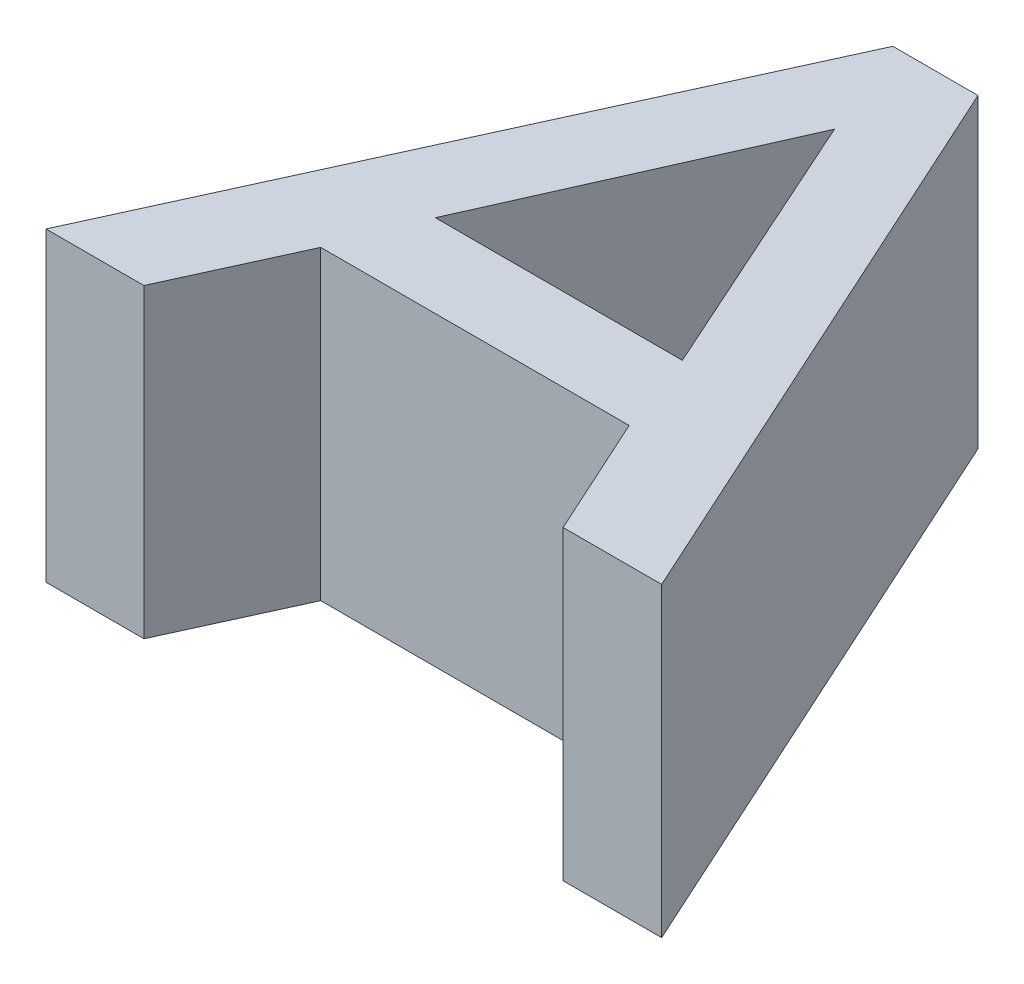
ISO-10303-21;
HEADER;
FILE_DESCRIPTION(('STEP AP214'),'2;1');
FILE_NAME('part.step','',(''),(''),'','','');
FILE_SCHEMA(('AUTOMOTIVE_DESIGN { 1 0 10303 214 1 1 1 1 }'));
ENDSEC;
DATA;
#1=APPLICATION_CONTEXT('core data for automotive mechanical design processes');
#2=APPLICATION_PROTOCOL_DEFINITION('international standard','automotive_design',2000,#1);
#3=PRODUCT_CONTEXT('',#1,'mechanical');
#4=PRODUCT('Part','Part','',(#3));
#5=PRODUCT_RELATED_PRODUCT_CATEGORY('part','',(#4));
#6=PRODUCT_DEFINITION_FORMATION('','',#4);
#7=PRODUCT_DEFINITION_CONTEXT('part definition',#1,'design');
#8=PRODUCT_DEFINITION('design','',#6,#7);
#9=PRODUCT_DEFINITION_SHAPE('','',#8);
#10=(LENGTH_UNIT() NAMED_UNIT(*) SI_UNIT(.MILLI.,.METRE.));
#11=(NAMED_UNIT(*) PLANE_ANGLE_UNIT() SI_UNIT($,.RADIAN.));
#12=(NAMED_UNIT(*) SI_UNIT($,.STERADIAN.) SOLID_ANGLE_UNIT());
#13=UNCERTAINTY_MEASURE_WITH_UNIT(LENGTH_MEASURE(1.E-05),#10,'distance_accuracy_value','');
#14=(GEOMETRIC_REPRESENTATION_CONTEXT(3) GLOBAL_UNCERTAINTY_ASSIGNED_CONTEXT((#13)) GLOBAL_UNIT_ASSIGNED_CONTEXT((#10,
#11,#12)) REPRESENTATION_CONTEXT('',''));
#15=CARTESIAN_POINT('',(0.,0.,0.));
#16=DIRECTION('',(0.,0.,1.));
#17=DIRECTION('',(1.,0.,0.));
#18=AXIS2_PLACEMENT_3D('',#15,#16,#17);
#19=CARTESIAN_POINT('',(0.,10.,0.));
#20=DIRECTION('',(0.,-1.,0.));
#21=DIRECTION('',(0.,0.,-1.));
#22=AXIS2_PLACEMENT_3D('',#19,#20,#21);
#23=PLANE('',#22);
#24=DIRECTION('',(1.,0.,0.));
#25=VECTOR('',#24,1.);
#26=CARTESIAN_POINT('',(5.13376068780192,10.,-56.28859622837));
#27=LINE('',#26,#25);
#28=CARTESIAN_POINT('',(1.93256639034886,10.,-56.28859622837));
#29=VERTEX_POINT('',#28);
#30=CARTESIAN_POINT('',(5.13376068780192,10.,-56.28859622837));
#31=VERTEX_POINT('',#30);
#32=EDGE_CURVE('E140',#29,#31,#27,.T.);
#33=ORIENTED_EDGE('',*,*,#32,.T.);
#34=DIRECTION('',(0.414949894533641,0.,-0.909844264160917));
#35=VECTOR('',#34,1.);
#36=CARTESIAN_POINT('',(6.94327029674774,10.,-60.2562365635815));
#37=LINE('',#36,#35);
#38=CARTESIAN_POINT('',(6.94327029674774,10.,-60.2562365635815));
#39=VERTEX_POINT('',#38);
#40=EDGE_CURVE('E143',#31,#39,#37,.T.);
#41=ORIENTED_EDGE('',*,*,#40,.T.);
#42=DIRECTION('',(1.,0.,0.));
#43=VECTOR('',#42,1.);
#44=CARTESIAN_POINT('',(17.0242405926691,10.,-60.2562365635815));
#45=LINE('',#44,#43);
#46=CARTESIAN_POINT('',(17.0242405926691,10.,-60.2562365635815));
#47=VERTEX_POINT('',#46);
#48=EDGE_CURVE('E146',#39,#47,#45,.T.);
#49=ORIENTED_EDGE('',*,*,#48,.T.);
#50=DIRECTION('',(0.41494989453364,0.,0.909844264160917));
#51=VECTOR('',#50,1.);
#52=CARTESIAN_POINT('',(18.8337502016149,10.,-56.28859622837));
#53=LINE('',#52,#51);
#54=CARTESIAN_POINT('',(18.8337502016149,10.,-56.28859622837));
#55=VERTEX_POINT('',#54);
#56=EDGE_CURVE('E148',#47,#55,#53,.T.);
#57=ORIENTED_EDGE('',*,*,#56,.T.);
#58=DIRECTION('',(1.,0.,0.));
#59=VECTOR('',#58,1.);
#60=CARTESIAN_POINT('',(22.0549169985857,10.,-56.28859622837));
#61=LINE('',#60,#59);
#62=CARTESIAN_POINT('',(22.0549169985857,10.,-56.28859622837));
#63=VERTEX_POINT('',#62);
#64=EDGE_CURVE('E150',#55,#63,#61,.T.);
#65=ORIENTED_EDGE('',*,*,#64,.T.);
#66=DIRECTION('',(-0.41494989453364,0.,-0.909844264160917));
#67=VECTOR('',#66,1.);
#68=CARTESIAN_POINT('',(13.3856038906892,10.,-75.2974570796293));
#69=LINE('',#68,#67);
#70=CARTESIAN_POINT('',(13.3856038906892,10.,-75.2974570796293));
#71=VERTEX_POINT('',#70);
#72=EDGE_CURVE('E152',#63,#71,#69,.T.);
#73=ORIENTED_EDGE('',*,*,#72,.T.);
#74=DIRECTION('',(-1.,0.,0.));
#75=VECTOR('',#74,1.);
#76=CARTESIAN_POINT('',(10.6018794982453,10.,-75.2974570796293));
#77=LINE('',#76,#75);
#78=CARTESIAN_POINT('',(10.6018794982453,10.,-75.2974570796293));
#79=VERTEX_POINT('',#78);
#80=EDGE_CURVE('E154',#71,#79,#77,.T.);
#81=ORIENTED_EDGE('',*,*,#80,.T.);
#82=DIRECTION('',(-0.41494989453364,0.,0.909844264160917));
#83=VECTOR('',#82,1.);
#84=CARTESIAN_POINT('',(1.93256639034886,10.,-56.28859622837));
#85=LINE('',#84,#83);
#86=EDGE_CURVE('E156',#79,#29,#85,.T.);
#87=ORIENTED_EDGE('',*,*,#86,.T.);
#88=EDGE_LOOP('',(#33,#41,#49,#57,#65,#73,#81,#87));
#89=FACE_BOUND('',#88,.T.);
#90=DIRECTION('',(1.,0.,0.));
#91=VECTOR('',#90,1.);
#92=CARTESIAN_POINT('',(16.0500258091711,10.,-62.9695347702352));
#93=LINE('',#92,#91);
#94=CARTESIAN_POINT('',(7.97722507108402,10.,-62.9695347702352));
#95=VERTEX_POINT('',#94);
#96=CARTESIAN_POINT('',(16.0500258091711,10.,-62.9695347702352));
#97=VERTEX_POINT('',#96);
#98=EDGE_CURVE('E113',#95,#97,#93,.T.);
#99=ORIENTED_EDGE('',*,*,#98,.F.);
#100=DIRECTION('',(-0.406511873689454,0.,0.913645498292138));
#101=VECTOR('',#100,1.);
#102=CARTESIAN_POINT('',(7.97722507108402,10.,-62.9695347702352));
#103=LINE('',#102,#101);
#104=CARTESIAN_POINT('',(11.9937416944672,10.,-71.9967553000173));
#105=VERTEX_POINT('',#104);
#106=EDGE_CURVE('E130',#105,#95,#103,.T.);
#107=ORIENTED_EDGE('',*,*,#106,.F.);
#108=DIRECTION('',(-0.409863376039173,0.,-0.912146925106789));
#109=VECTOR('',#108,1.);
#110=CARTESIAN_POINT('',(11.9937416944672,10.,-71.9967553000173));
#111=LINE('',#110,#109);
#112=EDGE_CURVE('E121',#97,#105,#111,.T.);
#113=ORIENTED_EDGE('',*,*,#112,.F.);
#114=EDGE_LOOP('',(#99,#107,#113));
#115=FACE_BOUND('',#114,.T.);
#116=ADVANCED_FACE('F30',(#89,#115),#23,.F.);
#117=CARTESIAN_POINT('',(0.,0.,0.));
#118=DIRECTION('',(0.,-1.,0.));
#119=DIRECTION('',(0.,0.,-1.));
#120=AXIS2_PLACEMENT_3D('',#117,#118,#119);
#121=PLANE('',#120);
#122=DIRECTION('',(1.,0.,0.));
#123=VECTOR('',#122,1.);
#124=CARTESIAN_POINT('',(5.13376068780192,0.,-56.28859622837));
#125=LINE('',#124,#123);
#126=CARTESIAN_POINT('',(1.93256639034886,0.,-56.28859622837));
#127=VERTEX_POINT('',#126);
#128=CARTESIAN_POINT('',(5.13376068780192,0.,-56.28859622837));
#129=VERTEX_POINT('',#128);
#130=EDGE_CURVE('E128',#127,#129,#125,.T.);
#131=ORIENTED_EDGE('',*,*,#130,.F.);
#132=DIRECTION('',(-0.41494989453364,0.,0.909844264160917));
#133=VECTOR('',#132,1.);
#134=CARTESIAN_POINT('',(1.93256639034886,0.,-56.28859622837));
#135=LINE('',#134,#133);
#136=CARTESIAN_POINT('',(10.6018794982453,0.,-75.2974570796293));
#137=VERTEX_POINT('',#136);
#138=EDGE_CURVE('E144',#137,#127,#135,.T.);
#139=ORIENTED_EDGE('',*,*,#138,.F.);
#140=DIRECTION('',(-1.,0.,0.));
#141=VECTOR('',#140,1.);
#142=CARTESIAN_POINT('',(10.6018794982453,0.,-75.2974570796293));
#143=LINE('',#142,#141);
#144=CARTESIAN_POINT('',(13.3856038906892,0.,-75.2974570796293));
#145=VERTEX_POINT('',#144);
#146=EDGE_CURVE('E171',#145,#137,#143,.T.);
#147=ORIENTED_EDGE('',*,*,#146,.F.);
#148=DIRECTION('',(-0.41494989453364,0.,-0.909844264160917));
#149=VECTOR('',#148,1.);
#150=CARTESIAN_POINT('',(13.3856038906892,0.,-75.2974570796293));
#151=LINE('',#150,#149);
#152=CARTESIAN_POINT('',(22.0549169985857,0.,-56.28859622837));
#153=VERTEX_POINT('',#152);
#154=EDGE_CURVE('E169',#153,#145,#151,.T.);
#155=ORIENTED_EDGE('',*,*,#154,.F.);
#156=DIRECTION('',(1.,0.,0.));
#157=VECTOR('',#156,1.);
#158=CARTESIAN_POINT('',(22.0549169985857,0.,-56.28859622837));
#159=LINE('',#158,#157);
#160=CARTESIAN_POINT('',(18.8337502016149,0.,-56.28859622837));
#161=VERTEX_POINT('',#160);
#162=EDGE_CURVE('E167',#161,#153,#159,.T.);
#163=ORIENTED_EDGE('',*,*,#162,.F.);
#164=DIRECTION('',(0.41494989453364,0.,0.909844264160917));
#165=VECTOR('',#164,1.);
#166=CARTESIAN_POINT('',(18.8337502016149,0.,-56.28859622837));
#167=LINE('',#166,#165);
#168=CARTESIAN_POINT('',(17.0242405926691,0.,-60.2562365635815));
#169=VERTEX_POINT('',#168);
#170=EDGE_CURVE('E165',#169,#161,#167,.T.);
#171=ORIENTED_EDGE('',*,*,#170,.F.);
#172=DIRECTION('',(1.,0.,0.));
#173=VECTOR('',#172,1.);
#174=CARTESIAN_POINT('',(17.0242405926691,0.,-60.2562365635815));
#175=LINE('',#174,#173);
#176=CARTESIAN_POINT('',(6.94327029674774,0.,-60.2562365635815));
#177=VERTEX_POINT('',#176);
#178=EDGE_CURVE('E163',#177,#169,#175,.T.);
#179=ORIENTED_EDGE('',*,*,#178,.F.);
#180=DIRECTION('',(0.414949894533641,0.,-0.909844264160917));
#181=VECTOR('',#180,1.);
#182=CARTESIAN_POINT('',(6.94327029674774,0.,-60.2562365635815));
#183=LINE('',#182,#181);
#184=EDGE_CURVE('E161',#129,#177,#183,.T.);
#185=ORIENTED_EDGE('',*,*,#184,.F.);
#186=EDGE_LOOP('',(#131,#139,#147,#155,#163,#171,#179,#185));
#187=FACE_BOUND('',#186,.T.);
#188=DIRECTION('',(-0.406511873689454,0.,0.913645498292138));
#189=VECTOR('',#188,1.);
#190=CARTESIAN_POINT('',(7.97722507108402,0.,-62.9695347702352));
#191=LINE('',#190,#189);
#192=CARTESIAN_POINT('',(11.9937416944672,0.,-71.9967553000173));
#193=VERTEX_POINT('',#192);
#194=CARTESIAN_POINT('',(7.97722507108401,0.,-62.9695347702352));
#195=VERTEX_POINT('',#194);
#196=EDGE_CURVE('E122',#193,#195,#191,.T.);
#197=ORIENTED_EDGE('',*,*,#196,.T.);
#198=DIRECTION('',(1.,0.,0.));
#199=VECTOR('',#198,1.);
#200=CARTESIAN_POINT('',(16.0500258091711,0.,-62.9695347702352));
#201=LINE('',#200,#199);
#202=CARTESIAN_POINT('',(16.0500258091711,0.,-62.9695347702352));
#203=VERTEX_POINT('',#202);
#204=EDGE_CURVE('E53',#195,#203,#201,.T.);
#205=ORIENTED_EDGE('',*,*,#204,.T.);
#206=DIRECTION('',(-0.409863376039173,0.,-0.912146925106789));
#207=VECTOR('',#206,1.);
#208=CARTESIAN_POINT('',(11.9937416944672,0.,-71.9967553000173));
#209=LINE('',#208,#207);
#210=EDGE_CURVE('E127',#203,#193,#209,.T.);
#211=ORIENTED_EDGE('',*,*,#210,.T.);
#212=EDGE_LOOP('',(#197,#205,#211));
#213=FACE_BOUND('',#212,.T.);
#214=ADVANCED_FACE('F201',(#187,#213),#121,.T.);
#215=CARTESIAN_POINT('',(5.13376068780192,10.,-56.28859622837));
#216=DIRECTION('',(0.,0.,-1.));
#217=DIRECTION('',(-1.,0.,0.));
#218=AXIS2_PLACEMENT_3D('',#215,#216,#217);
#219=PLANE('',#218);
#220=ORIENTED_EDGE('',*,*,#130,.T.);
#221=DIRECTION('',(0.,-1.,0.));
#222=VECTOR('',#221,1.);
#223=CARTESIAN_POINT('',(5.13376068780192,10.,-56.28859622837));
#224=LINE('',#223,#222);
#225=EDGE_CURVE('E11',#31,#129,#224,.T.);
#226=ORIENTED_EDGE('',*,*,#225,.F.);
#227=ORIENTED_EDGE('',*,*,#32,.F.);
#228=DIRECTION('',(0.,-1.,0.));
#229=VECTOR('',#228,1.);
#230=CARTESIAN_POINT('',(1.93256639034886,10.,-56.28859622837));
#231=LINE('',#230,#229);
#232=EDGE_CURVE('E158',#29,#127,#231,.T.);
#233=ORIENTED_EDGE('',*,*,#232,.T.);
#234=EDGE_LOOP('',(#220,#226,#227,#233));
#235=FACE_BOUND('',#234,.T.);
#236=ADVANCED_FACE('F32',(#235),#219,.F.);
#237=CARTESIAN_POINT('',(6.94327029674774,10.,-60.2562365635815));
#238=DIRECTION('',(-0.909844264160917,0.,-0.414949894533641));
#239=DIRECTION('',(-0.414949894533641,0.,0.909844264160917));
#240=AXIS2_PLACEMENT_3D('',#237,#238,#239);
#241=PLANE('',#240);
#242=ORIENTED_EDGE('',*,*,#184,.T.);
#243=DIRECTION('',(0.,-1.,0.));
#244=VECTOR('',#243,1.);
#245=CARTESIAN_POINT('',(6.94327029674774,10.,-60.2562365635815));
#246=LINE('',#245,#244);
#247=EDGE_CURVE('E38',#39,#177,#246,.T.);
#248=ORIENTED_EDGE('',*,*,#247,.F.);
#249=ORIENTED_EDGE('',*,*,#40,.F.);
#250=ORIENTED_EDGE('',*,*,#225,.T.);
#251=EDGE_LOOP('',(#242,#248,#249,#250));
#252=FACE_BOUND('',#251,.T.);
#253=ADVANCED_FACE('F218',(#252),#241,.F.);
#254=CARTESIAN_POINT('',(17.0242405926691,10.,-60.2562365635815));
#255=DIRECTION('',(0.,0.,-1.));
#256=DIRECTION('',(-1.,0.,0.));
#257=AXIS2_PLACEMENT_3D('',#254,#255,#256);
#258=PLANE('',#257);
#259=ORIENTED_EDGE('',*,*,#178,.T.);
#260=DIRECTION('',(0.,-1.,0.));
#261=VECTOR('',#260,1.);
#262=CARTESIAN_POINT('',(17.0242405926691,10.,-60.2562365635815));
#263=LINE('',#262,#261);
#264=EDGE_CURVE('E188',#47,#169,#263,.T.);
#265=ORIENTED_EDGE('',*,*,#264,.F.);
#266=ORIENTED_EDGE('',*,*,#48,.F.);
#267=ORIENTED_EDGE('',*,*,#247,.T.);
#268=EDGE_LOOP('',(#259,#265,#266,#267));
#269=FACE_BOUND('',#268,.T.);
#270=ADVANCED_FACE('F195',(#269),#258,.F.);
#271=CARTESIAN_POINT('',(18.8337502016149,10.,-56.28859622837));
#272=DIRECTION('',(0.909844264160917,0.,-0.41494989453364));
#273=DIRECTION('',(-0.41494989453364,0.,-0.909844264160917));
#274=AXIS2_PLACEMENT_3D('',#271,#272,#273);
#275=PLANE('',#274);
#276=ORIENTED_EDGE('',*,*,#170,.T.);
#277=DIRECTION('',(0.,-1.,0.));
#278=VECTOR('',#277,1.);
#279=CARTESIAN_POINT('',(18.8337502016149,10.,-56.28859622837));
#280=LINE('',#279,#278);
#281=EDGE_CURVE('E185',#55,#161,#280,.T.);
#282=ORIENTED_EDGE('',*,*,#281,.F.);
#283=ORIENTED_EDGE('',*,*,#56,.F.);
#284=ORIENTED_EDGE('',*,*,#264,.T.);
#285=EDGE_LOOP('',(#276,#282,#283,#284));
#286=FACE_BOUND('',#285,.T.);
#287=ADVANCED_FACE('F207',(#286),#275,.F.);
#288=CARTESIAN_POINT('',(22.0549169985857,10.,-56.28859622837));
#289=DIRECTION('',(0.,0.,-1.));
#290=DIRECTION('',(-1.,0.,0.));
#291=AXIS2_PLACEMENT_3D('',#288,#289,#290);
#292=PLANE('',#291);
#293=ORIENTED_EDGE('',*,*,#162,.T.);
#294=DIRECTION('',(0.,-1.,0.));
#295=VECTOR('',#294,1.);
#296=CARTESIAN_POINT('',(22.0549169985857,10.,-56.28859622837));
#297=LINE('',#296,#295);
#298=EDGE_CURVE('E182',#63,#153,#297,.T.);
#299=ORIENTED_EDGE('',*,*,#298,.F.);
#300=ORIENTED_EDGE('',*,*,#64,.F.);
#301=ORIENTED_EDGE('',*,*,#281,.T.);
#302=EDGE_LOOP('',(#293,#299,#300,#301));
#303=FACE_BOUND('',#302,.T.);
#304=ADVANCED_FACE('F211',(#303),#292,.F.);
#305=CARTESIAN_POINT('',(13.3856038906892,10.,-75.2974570796293));
#306=DIRECTION('',(-0.909844264160917,0.,0.41494989453364));
#307=DIRECTION('',(0.41494989453364,0.,0.909844264160917));
#308=AXIS2_PLACEMENT_3D('',#305,#306,#307);
#309=PLANE('',#308);
#310=ORIENTED_EDGE('',*,*,#154,.T.);
#311=DIRECTION('',(0.,-1.,0.));
#312=VECTOR('',#311,1.);
#313=CARTESIAN_POINT('',(13.3856038906892,10.,-75.2974570796293));
#314=LINE('',#313,#312);
#315=EDGE_CURVE('E179',#71,#145,#314,.T.);
#316=ORIENTED_EDGE('',*,*,#315,.F.);
#317=ORIENTED_EDGE('',*,*,#72,.F.);
#318=ORIENTED_EDGE('',*,*,#298,.T.);
#319=EDGE_LOOP('',(#310,#316,#317,#318));
#320=FACE_BOUND('',#319,.T.);
#321=ADVANCED_FACE('F231',(#320),#309,.F.);
#322=CARTESIAN_POINT('',(10.6018794982453,10.,-75.2974570796293));
#323=DIRECTION('',(0.,0.,1.));
#324=DIRECTION('',(1.,0.,0.));
#325=AXIS2_PLACEMENT_3D('',#322,#323,#324);
#326=PLANE('',#325);
#327=ORIENTED_EDGE('',*,*,#146,.T.);
#328=DIRECTION('',(0.,-1.,0.));
#329=VECTOR('',#328,1.);
#330=CARTESIAN_POINT('',(10.6018794982453,10.,-75.2974570796293));
#331=LINE('',#330,#329);
#332=EDGE_CURVE('E176',#79,#137,#331,.T.);
#333=ORIENTED_EDGE('',*,*,#332,.F.);
#334=ORIENTED_EDGE('',*,*,#80,.F.);
#335=ORIENTED_EDGE('',*,*,#315,.T.);
#336=EDGE_LOOP('',(#327,#333,#334,#335));
#337=FACE_BOUND('',#336,.T.);
#338=ADVANCED_FACE('F229',(#337),#326,.F.);
#339=CARTESIAN_POINT('',(1.93256639034886,10.,-56.28859622837));
#340=DIRECTION('',(0.909844264160917,0.,0.41494989453364));
#341=DIRECTION('',(0.41494989453364,0.,-0.909844264160917));
#342=AXIS2_PLACEMENT_3D('',#339,#340,#341);
#343=PLANE('',#342);
#344=ORIENTED_EDGE('',*,*,#138,.T.);
#345=ORIENTED_EDGE('',*,*,#232,.F.);
#346=ORIENTED_EDGE('',*,*,#86,.F.);
#347=ORIENTED_EDGE('',*,*,#332,.T.);
#348=EDGE_LOOP('',(#344,#345,#346,#347));
#349=FACE_BOUND('',#348,.T.);
#350=ADVANCED_FACE('F224',(#349),#343,.F.);
#351=CARTESIAN_POINT('',(16.0500258091711,10.,-62.9695347702352));
#352=DIRECTION('',(0.,0.,-1.));
#353=DIRECTION('',(-1.,0.,0.));
#354=AXIS2_PLACEMENT_3D('',#351,#352,#353);
#355=PLANE('',#354);
#356=ORIENTED_EDGE('',*,*,#204,.F.);
#357=DIRECTION('',(0.,-1.,0.));
#358=VECTOR('',#357,1.);
#359=CARTESIAN_POINT('',(7.97722507108402,10.,-62.9695347702352));
#360=LINE('',#359,#358);
#361=EDGE_CURVE('E117',#95,#195,#360,.T.);
#362=ORIENTED_EDGE('',*,*,#361,.F.);
#363=ORIENTED_EDGE('',*,*,#98,.T.);
#364=DIRECTION('',(0.,-1.,0.));
#365=VECTOR('',#364,1.);
#366=CARTESIAN_POINT('',(16.0500258091711,10.,-62.9695347702352));
#367=LINE('',#366,#365);
#368=EDGE_CURVE('E116',#97,#203,#367,.T.);
#369=ORIENTED_EDGE('',*,*,#368,.T.);
#370=EDGE_LOOP('',(#356,#362,#363,#369));
#371=FACE_BOUND('',#370,.T.);
#372=ADVANCED_FACE('F115',(#371),#355,.T.);
#373=CARTESIAN_POINT('',(11.9937416944672,10.,-71.9967553000173));
#374=DIRECTION('',(-0.912146925106789,0.,0.409863376039173));
#375=DIRECTION('',(0.409863376039173,0.,0.912146925106789));
#376=AXIS2_PLACEMENT_3D('',#373,#374,#375);
#377=PLANE('',#376);
#378=ORIENTED_EDGE('',*,*,#210,.F.);
#379=ORIENTED_EDGE('',*,*,#368,.F.);
#380=ORIENTED_EDGE('',*,*,#112,.T.);
#381=DIRECTION('',(0.,-1.,0.));
#382=VECTOR('',#381,1.);
#383=CARTESIAN_POINT('',(11.9937416944672,10.,-71.9967553000173));
#384=LINE('',#383,#382);
#385=EDGE_CURVE('E45',#105,#193,#384,.T.);
#386=ORIENTED_EDGE('',*,*,#385,.T.);
#387=EDGE_LOOP('',(#378,#379,#380,#386));
#388=FACE_BOUND('',#387,.T.);
#389=ADVANCED_FACE('F125',(#388),#377,.T.);
#390=CARTESIAN_POINT('',(7.97722507108402,10.,-62.9695347702352));
#391=DIRECTION('',(0.913645498292138,0.,0.406511873689454));
#392=DIRECTION('',(0.406511873689454,0.,-0.913645498292138));
#393=AXIS2_PLACEMENT_3D('',#390,#391,#392);
#394=PLANE('',#393);
#395=ORIENTED_EDGE('',*,*,#196,.F.);
#396=ORIENTED_EDGE('',*,*,#385,.F.);
#397=ORIENTED_EDGE('',*,*,#106,.T.);
#398=ORIENTED_EDGE('',*,*,#361,.T.);
#399=EDGE_LOOP('',(#395,#396,#397,#398));
#400=FACE_BOUND('',#399,.T.);
#401=ADVANCED_FACE('F256',(#400),#394,.T.);
#402=CLOSED_SHELL('',(#116,#214,#236,#253,#270,#287,#304,#321,#338,#350,#372,#389,#401));
#403=MANIFOLD_SOLID_BREP('B2',#402);
#404=ADVANCED_BREP_SHAPE_REPRESENTATION('',(#18,#403),#14);
#405=SHAPE_DEFINITION_REPRESENTATION(#9,#404);
ENDSEC;
END-ISO-10303-21;
